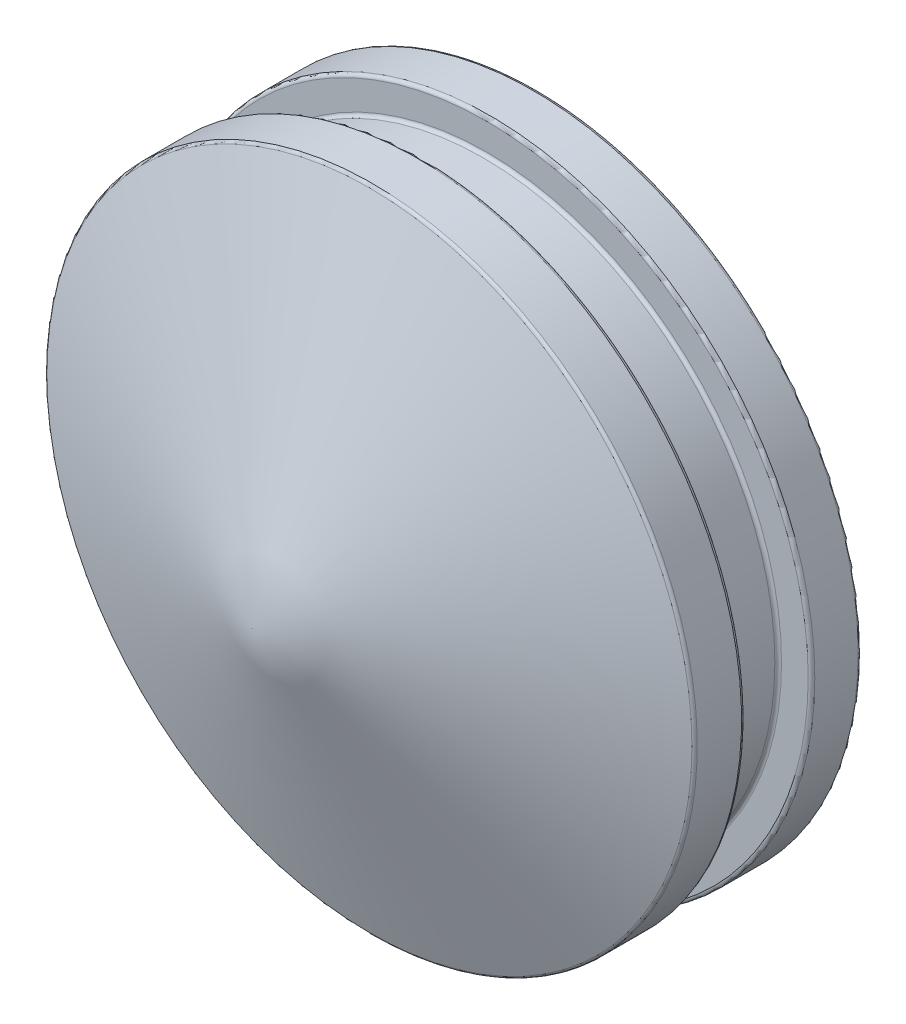
ISO-10303-21;
HEADER;
FILE_DESCRIPTION(('STEP AP214'),'2;1');
FILE_NAME('part.step','',(''),(''),'','','');
FILE_SCHEMA(('AUTOMOTIVE_DESIGN { 1 0 10303 214 1 1 1 1 }'));
ENDSEC;
DATA;
#1=APPLICATION_CONTEXT('core data for automotive mechanical design processes');
#2=APPLICATION_PROTOCOL_DEFINITION('international standard','automotive_design',2000,#1);
#3=PRODUCT_CONTEXT('',#1,'mechanical');
#4=PRODUCT('Part','Part','',(#3));
#5=PRODUCT_RELATED_PRODUCT_CATEGORY('part','',(#4));
#6=PRODUCT_DEFINITION_FORMATION('','',#4);
#7=PRODUCT_DEFINITION_CONTEXT('part definition',#1,'design');
#8=PRODUCT_DEFINITION('design','',#6,#7);
#9=PRODUCT_DEFINITION_SHAPE('','',#8);
#10=(LENGTH_UNIT() NAMED_UNIT(*) SI_UNIT(.MILLI.,.METRE.));
#11=(NAMED_UNIT(*) PLANE_ANGLE_UNIT() SI_UNIT($,.RADIAN.));
#12=(NAMED_UNIT(*) SI_UNIT($,.STERADIAN.) SOLID_ANGLE_UNIT());
#13=UNCERTAINTY_MEASURE_WITH_UNIT(LENGTH_MEASURE(1.E-05),#10,'distance_accuracy_value','');
#14=(GEOMETRIC_REPRESENTATION_CONTEXT(3) GLOBAL_UNCERTAINTY_ASSIGNED_CONTEXT((#13)) GLOBAL_UNIT_ASSIGNED_CONTEXT((#10,
#11,#12)) REPRESENTATION_CONTEXT('',''));
#15=CARTESIAN_POINT('',(0.,0.,0.));
#16=DIRECTION('',(0.,0.,1.));
#17=DIRECTION('',(1.,0.,0.));
#18=AXIS2_PLACEMENT_3D('',#15,#16,#17);
#19=CARTESIAN_POINT('',(8.75000000000004,0.,-7.04870978409553));
#20=DIRECTION('',(0.,0.,1.));
#21=DIRECTION('',(1.,0.,0.));
#22=AXIS2_PLACEMENT_3D('',#19,#20,#21);
#23=PLANE('',#22);
#24=CARTESIAN_POINT('',(0.,0.,-7.0487097840955));
#25=DIRECTION('',(0.,0.,1.));
#26=DIRECTION('',(1.,0.,0.));
#27=AXIS2_PLACEMENT_3D('',#24,#25,#26);
#28=CIRCLE('',#27,8.85000000000006);
#29=CARTESIAN_POINT('',(8.85000000000004,0.,-7.04870978409553));
#30=VERTEX_POINT('',#29);
#31=EDGE_CURVE('E127',#30,#30,#28,.F.);
#32=ORIENTED_EDGE('',*,*,#31,.T.);
#33=EDGE_LOOP('',(#32));
#34=FACE_BOUND('',#33,.T.);
#35=CARTESIAN_POINT('',(0.,0.,-7.0487097840955));
#36=DIRECTION('',(0.,0.,1.));
#37=DIRECTION('',(1.,0.,0.));
#38=AXIS2_PLACEMENT_3D('',#35,#36,#37);
#39=CIRCLE('',#38,9.65000000000007);
#40=CARTESIAN_POINT('',(9.65000000000004,0.,-7.04870978409553));
#41=VERTEX_POINT('',#40);
#42=EDGE_CURVE('E129',#41,#41,#39,.T.);
#43=ORIENTED_EDGE('',*,*,#42,.T.);
#44=EDGE_LOOP('',(#43));
#45=FACE_BOUND('',#44,.T.);
#46=ADVANCED_FACE('F32',(#34,#45),#23,.T.);
#47=CARTESIAN_POINT('',(3.49148133884313E-12,0.,1000.));
#48=DIRECTION('',(0.,0.,1.));
#49=DIRECTION('',(1.,0.,0.));
#50=AXIS2_PLACEMENT_3D('',#47,#48,#49);
#51=CYLINDRICAL_SURFACE('',#50,9.75000000000007);
#52=CARTESIAN_POINT('',(0.,0.,-8.44870978409551));
#53=DIRECTION('',(0.,0.,-1.));
#54=DIRECTION('',(-1.,0.,0.));
#55=AXIS2_PLACEMENT_3D('',#52,#53,#54);
#56=CIRCLE('',#55,9.75000000000007);
#57=CARTESIAN_POINT('',(-9.7500000000001,0.,-8.44870978409547));
#58=VERTEX_POINT('',#57);
#59=EDGE_CURVE('E119',#58,#58,#56,.F.);
#60=ORIENTED_EDGE('',*,*,#59,.T.);
#61=EDGE_LOOP('',(#60));
#62=FACE_BOUND('',#61,.T.);
#63=CARTESIAN_POINT('',(0.,0.,-7.14870978409543));
#64=DIRECTION('',(0.,0.,1.));
#65=DIRECTION('',(1.,0.,0.));
#66=AXIS2_PLACEMENT_3D('',#63,#64,#65);
#67=CIRCLE('',#66,9.75000000000007);
#68=CARTESIAN_POINT('',(9.75000000000004,0.,-7.14870978409546));
#69=VERTEX_POINT('',#68);
#70=EDGE_CURVE('E124',#69,#69,#67,.F.);
#71=ORIENTED_EDGE('',*,*,#70,.T.);
#72=EDGE_LOOP('',(#71));
#73=FACE_BOUND('',#72,.T.);
#74=ADVANCED_FACE('F59',(#62,#73),#51,.T.);
#75=CARTESIAN_POINT('',(9.75000000000004,0.,-8.54870978409554));
#76=DIRECTION('',(0.,0.,-1.));
#77=DIRECTION('',(-1.,0.,0.));
#78=AXIS2_PLACEMENT_3D('',#75,#76,#77);
#79=PLANE('',#78);
#80=CARTESIAN_POINT('',(0.,0.,-8.54870978409551));
#81=DIRECTION('',(0.,0.,-1.));
#82=DIRECTION('',(-1.,0.,0.));
#83=AXIS2_PLACEMENT_3D('',#80,#81,#82);
#84=CIRCLE('',#83,4.10000000000003);
#85=CARTESIAN_POINT('',(-4.10000000000006,0.,-8.54870978409549));
#86=VERTEX_POINT('',#85);
#87=EDGE_CURVE('E142',#86,#86,#84,.F.);
#88=ORIENTED_EDGE('',*,*,#87,.T.);
#89=EDGE_LOOP('',(#88));
#90=FACE_BOUND('',#89,.T.);
#91=CARTESIAN_POINT('',(0.,0.,-8.54870978409551));
#92=DIRECTION('',(0.,0.,-1.));
#93=DIRECTION('',(-1.,0.,0.));
#94=AXIS2_PLACEMENT_3D('',#91,#92,#93);
#95=CIRCLE('',#94,9.65000000000007);
#96=CARTESIAN_POINT('',(-9.6500000000001,0.,-8.54870978409548));
#97=VERTEX_POINT('',#96);
#98=EDGE_CURVE('E145',#97,#97,#95,.T.);
#99=ORIENTED_EDGE('',*,*,#98,.T.);
#100=EDGE_LOOP('',(#99));
#101=FACE_BOUND('',#100,.T.);
#102=ADVANCED_FACE('F65',(#90,#101),#79,.T.);
#103=CARTESIAN_POINT('',(3.49148133884313E-12,0.,1000.));
#104=DIRECTION('',(0.,0.,1.));
#105=DIRECTION('',(1.,0.,0.));
#106=AXIS2_PLACEMENT_3D('',#103,#104,#105);
#107=CYLINDRICAL_SURFACE('',#106,4.00000000000003);
#108=CARTESIAN_POINT('',(0.,0.,-6.14870978409554));
#109=DIRECTION('',(0.,0.,1.));
#110=DIRECTION('',(1.,0.,0.));
#111=AXIS2_PLACEMENT_3D('',#108,#109,#110);
#112=CIRCLE('',#111,4.00000000000003);
#113=CARTESIAN_POINT('',(4.,0.,-6.14870978409555));
#114=VERTEX_POINT('',#113);
#115=EDGE_CURVE('E163',#114,#114,#112,.T.);
#116=ORIENTED_EDGE('',*,*,#115,.T.);
#117=EDGE_LOOP('',(#116));
#118=FACE_BOUND('',#117,.T.);
#119=CARTESIAN_POINT('',(0.,0.,-8.44870978409551));
#120=DIRECTION('',(0.,0.,-1.));
#121=DIRECTION('',(-1.,0.,0.));
#122=AXIS2_PLACEMENT_3D('',#119,#120,#121);
#123=CIRCLE('',#122,4.00000000000003);
#124=CARTESIAN_POINT('',(-4.00000000000006,0.,-8.4487097840955));
#125=VERTEX_POINT('',#124);
#126=EDGE_CURVE('E166',#125,#125,#123,.T.);
#127=ORIENTED_EDGE('',*,*,#126,.T.);
#128=EDGE_LOOP('',(#127));
#129=FACE_BOUND('',#128,.T.);
#130=ADVANCED_FACE('F170',(#118,#129),#107,.F.);
#131=CARTESIAN_POINT('',(4.,0.,-6.04870978409553));
#132=DIRECTION('',(0.,0.,1.));
#133=DIRECTION('',(1.,0.,0.));
#134=AXIS2_PLACEMENT_3D('',#131,#132,#133);
#135=PLANE('',#134);
#136=CARTESIAN_POINT('',(0.,0.,-6.04870978409552));
#137=DIRECTION('',(0.,0.,1.));
#138=DIRECTION('',(1.,0.,0.));
#139=AXIS2_PLACEMENT_3D('',#136,#137,#138);
#140=CIRCLE('',#139,4.10000000000003);
#141=CARTESIAN_POINT('',(4.10000000000001,0.,-6.04870978409553));
#142=VERTEX_POINT('',#141);
#143=EDGE_CURVE('E157',#142,#142,#140,.F.);
#144=ORIENTED_EDGE('',*,*,#143,.T.);
#145=EDGE_LOOP('',(#144));
#146=FACE_BOUND('',#145,.T.);
#147=CARTESIAN_POINT('',(0.,0.,-6.04870978409552));
#148=DIRECTION('',(0.,0.,1.));
#149=DIRECTION('',(1.,0.,0.));
#150=AXIS2_PLACEMENT_3D('',#147,#148,#149);
#151=CIRCLE('',#150,4.90000000000002);
#152=CARTESIAN_POINT('',(4.9,0.,-6.04870978409553));
#153=VERTEX_POINT('',#152);
#154=EDGE_CURVE('E160',#153,#153,#151,.T.);
#155=ORIENTED_EDGE('',*,*,#154,.T.);
#156=EDGE_LOOP('',(#155));
#157=FACE_BOUND('',#156,.T.);
#158=ADVANCED_FACE('F186',(#146,#157),#135,.T.);
#159=CARTESIAN_POINT('',(3.49148133884313E-12,0.,1000.));
#160=DIRECTION('',(0.,0.,1.));
#161=DIRECTION('',(1.,0.,0.));
#162=AXIS2_PLACEMENT_3D('',#159,#160,#161);
#163=CYLINDRICAL_SURFACE('',#162,5.00000000000002);
#164=CARTESIAN_POINT('',(0.,0.,-4.64870978409548));
#165=DIRECTION('',(0.,0.,-1.));
#166=DIRECTION('',(-1.,0.,0.));
#167=AXIS2_PLACEMENT_3D('',#164,#165,#166);
#168=CIRCLE('',#167,5.00000000000002);
#169=CARTESIAN_POINT('',(-5.00000000000003,0.,-4.64870978409547));
#170=VERTEX_POINT('',#169);
#171=EDGE_CURVE('E151',#170,#170,#168,.F.);
#172=ORIENTED_EDGE('',*,*,#171,.T.);
#173=EDGE_LOOP('',(#172));
#174=FACE_BOUND('',#173,.T.);
#175=CARTESIAN_POINT('',(0.,0.,-5.94870978409556));
#176=DIRECTION('',(0.,0.,1.));
#177=DIRECTION('',(1.,0.,0.));
#178=AXIS2_PLACEMENT_3D('',#175,#176,#177);
#179=CIRCLE('',#178,5.00000000000002);
#180=CARTESIAN_POINT('',(5.,0.,-5.94870978409558));
#181=VERTEX_POINT('',#180);
#182=EDGE_CURVE('E154',#181,#181,#179,.F.);
#183=ORIENTED_EDGE('',*,*,#182,.T.);
#184=EDGE_LOOP('',(#183));
#185=FACE_BOUND('',#184,.T.);
#186=ADVANCED_FACE('F55',(#174,#185),#163,.F.);
#187=CARTESIAN_POINT('',(5.,0.,-4.54870978409554));
#188=DIRECTION('',(0.,0.,-1.));
#189=DIRECTION('',(-1.,0.,0.));
#190=AXIS2_PLACEMENT_3D('',#187,#188,#189);
#191=PLANE('',#190);
#192=CARTESIAN_POINT('',(0.,0.,-4.54870978409552));
#193=DIRECTION('',(0.,0.,-1.));
#194=DIRECTION('',(-1.,0.,0.));
#195=AXIS2_PLACEMENT_3D('',#192,#193,#194);
#196=CIRCLE('',#195,4.90000000000002);
#197=CARTESIAN_POINT('',(-4.90000000000003,0.,-4.54870978409551));
#198=VERTEX_POINT('',#197);
#199=EDGE_CURVE('E148',#198,#198,#196,.T.);
#200=ORIENTED_EDGE('',*,*,#199,.T.);
#201=EDGE_LOOP('',(#200));
#202=FACE_BOUND('',#201,.T.);
#203=ADVANCED_FACE('F45',(#202),#191,.T.);
#204=CARTESIAN_POINT('',(0.,0.,0.));
#205=DIRECTION('',(0.,0.,-1.));
#206=DIRECTION('',(-1.,0.,0.));
#207=AXIS2_PLACEMENT_3D('',#204,#205,#206);
#208=CONICAL_SURFACE('',#207,0.,1.22173047639602);
#209=CARTESIAN_POINT('',(0.,0.,-3.52476127583798));
#210=DIRECTION('',(0.,0.,1.));
#211=DIRECTION('',(1.,0.,0.));
#212=AXIS2_PLACEMENT_3D('',#209,#210,#211);
#213=CIRCLE('',#212,9.6842020143326);
#214=CARTESIAN_POINT('',(9.68420201433259,0.,-3.52476127583801));
#215=VERTEX_POINT('',#214);
#216=EDGE_CURVE('E11',#215,#215,#213,.T.);
#217=ORIENTED_EDGE('',*,*,#216,.T.);
#218=EDGE_LOOP('',(#217));
#219=FACE_BOUND('',#218,.T.);
#220=CARTESIAN_POINT('',(0.,0.,0.));
#221=VERTEX_POINT('',#220);
#222=VERTEX_LOOP('',#221);
#223=FACE_BOUND('',#222,.T.);
#224=ADVANCED_FACE('F42',(#219,#223),#208,.T.);
#225=CARTESIAN_POINT('',(3.49148133884313E-12,0.,1000.));
#226=DIRECTION('',(0.,0.,1.));
#227=DIRECTION('',(1.,0.,0.));
#228=AXIS2_PLACEMENT_3D('',#225,#226,#227);
#229=CYLINDRICAL_SURFACE('',#228,9.75000000000006);
#230=CARTESIAN_POINT('',(0.,0.,-4.94870978409545));
#231=DIRECTION('',(0.,0.,-1.));
#232=DIRECTION('',(-1.,0.,0.));
#233=AXIS2_PLACEMENT_3D('',#230,#231,#232);
#234=CIRCLE('',#233,9.75000000000006);
#235=CARTESIAN_POINT('',(-9.75000000000007,0.,-4.94870978409542));
#236=VERTEX_POINT('',#235);
#237=EDGE_CURVE('E39',#236,#236,#234,.F.);
#238=ORIENTED_EDGE('',*,*,#237,.T.);
#239=EDGE_LOOP('',(#238));
#240=FACE_BOUND('',#239,.T.);
#241=CARTESIAN_POINT('',(0.,0.,-3.6187305379165));
#242=DIRECTION('',(0.,0.,-1.));
#243=DIRECTION('',(-1.,0.,0.));
#244=AXIS2_PLACEMENT_3D('',#241,#242,#243);
#245=CIRCLE('',#244,9.75000000000006);
#246=CARTESIAN_POINT('',(-9.75000000000007,0.,-3.61873053791647));
#247=VERTEX_POINT('',#246);
#248=EDGE_CURVE('E117',#247,#247,#245,.T.);
#249=ORIENTED_EDGE('',*,*,#248,.T.);
#250=EDGE_LOOP('',(#249));
#251=FACE_BOUND('',#250,.T.);
#252=ADVANCED_FACE('F44',(#240,#251),#229,.T.);
#253=CARTESIAN_POINT('',(9.75000000000004,0.,-5.04870978409553));
#254=DIRECTION('',(0.,0.,-1.));
#255=DIRECTION('',(-1.,0.,0.));
#256=AXIS2_PLACEMENT_3D('',#253,#254,#255);
#257=PLANE('',#256);
#258=CARTESIAN_POINT('',(0.,0.,-5.0487097840955));
#259=DIRECTION('',(0.,0.,-1.));
#260=DIRECTION('',(-1.,0.,0.));
#261=AXIS2_PLACEMENT_3D('',#258,#259,#260);
#262=CIRCLE('',#261,8.85000000000006);
#263=CARTESIAN_POINT('',(-8.85000000000008,0.,-5.04870978409547));
#264=VERTEX_POINT('',#263);
#265=EDGE_CURVE('E138',#264,#264,#262,.F.);
#266=ORIENTED_EDGE('',*,*,#265,.T.);
#267=EDGE_LOOP('',(#266));
#268=FACE_BOUND('',#267,.T.);
#269=CARTESIAN_POINT('',(0.,0.,-5.0487097840955));
#270=DIRECTION('',(0.,0.,-1.));
#271=DIRECTION('',(-1.,0.,0.));
#272=AXIS2_PLACEMENT_3D('',#269,#270,#271);
#273=CIRCLE('',#272,9.65000000000006);
#274=CARTESIAN_POINT('',(-9.65000000000007,0.,-5.04870978409547));
#275=VERTEX_POINT('',#274);
#276=EDGE_CURVE('E114',#275,#275,#273,.T.);
#277=ORIENTED_EDGE('',*,*,#276,.T.);
#278=EDGE_LOOP('',(#277));
#279=FACE_BOUND('',#278,.T.);
#280=ADVANCED_FACE('F52',(#268,#279),#257,.T.);
#281=CARTESIAN_POINT('',(3.49148133884313E-12,0.,1000.));
#282=DIRECTION('',(0.,0.,1.));
#283=DIRECTION('',(1.,0.,0.));
#284=AXIS2_PLACEMENT_3D('',#281,#282,#283);
#285=CYLINDRICAL_SURFACE('',#284,8.75000000000006);
#286=CARTESIAN_POINT('',(0.,0.,-5.14870978409543));
#287=DIRECTION('',(0.,0.,-1.));
#288=DIRECTION('',(-1.,0.,0.));
#289=AXIS2_PLACEMENT_3D('',#286,#287,#288);
#290=CIRCLE('',#289,8.75000000000006);
#291=CARTESIAN_POINT('',(-8.75000000000008,0.,-5.1487097840954));
#292=VERTEX_POINT('',#291);
#293=EDGE_CURVE('E132',#292,#292,#290,.T.);
#294=ORIENTED_EDGE('',*,*,#293,.T.);
#295=EDGE_LOOP('',(#294));
#296=FACE_BOUND('',#295,.T.);
#297=CARTESIAN_POINT('',(0.,0.,-6.94870978409545));
#298=DIRECTION('',(0.,0.,1.));
#299=DIRECTION('',(1.,0.,0.));
#300=AXIS2_PLACEMENT_3D('',#297,#298,#299);
#301=CIRCLE('',#300,8.75000000000006);
#302=CARTESIAN_POINT('',(8.75000000000004,0.,-6.94870978409548));
#303=VERTEX_POINT('',#302);
#304=EDGE_CURVE('E135',#303,#303,#301,.T.);
#305=ORIENTED_EDGE('',*,*,#304,.T.);
#306=EDGE_LOOP('',(#305));
#307=FACE_BOUND('',#306,.T.);
#308=ADVANCED_FACE('F76',(#296,#307),#285,.T.);
#309=CARTESIAN_POINT('',(0.,0.,-6.14870978409554));
#310=DIRECTION('',(0.,0.,1.));
#311=DIRECTION('',(1.,0.,0.));
#312=AXIS2_PLACEMENT_3D('',#309,#310,#311);
#313=TOROIDAL_SURFACE('',#312,4.10000000000003,0.1);
#314=ORIENTED_EDGE('',*,*,#143,.F.);
#315=EDGE_LOOP('',(#314));
#316=FACE_BOUND('',#315,.T.);
#317=ORIENTED_EDGE('',*,*,#115,.F.);
#318=EDGE_LOOP('',(#317));
#319=FACE_BOUND('',#318,.T.);
#320=ADVANCED_FACE('F72',(#316,#319),#313,.T.);
#321=CARTESIAN_POINT('',(0.,0.,-4.64870978409548));
#322=DIRECTION('',(0.,0.,-1.));
#323=DIRECTION('',(-1.,0.,0.));
#324=AXIS2_PLACEMENT_3D('',#321,#322,#323);
#325=TOROIDAL_SURFACE('',#324,4.90000000000002,0.1);
#326=ORIENTED_EDGE('',*,*,#199,.F.);
#327=EDGE_LOOP('',(#326));
#328=FACE_BOUND('',#327,.T.);
#329=ORIENTED_EDGE('',*,*,#171,.F.);
#330=EDGE_LOOP('',(#329));
#331=FACE_BOUND('',#330,.T.);
#332=ADVANCED_FACE('F75',(#328,#331),#325,.F.);
#333=CARTESIAN_POINT('',(0.,0.,-5.94870978409556));
#334=DIRECTION('',(0.,0.,1.));
#335=DIRECTION('',(1.,0.,0.));
#336=AXIS2_PLACEMENT_3D('',#333,#334,#335);
#337=TOROIDAL_SURFACE('',#336,4.90000000000002,0.1);
#338=ORIENTED_EDGE('',*,*,#182,.F.);
#339=EDGE_LOOP('',(#338));
#340=FACE_BOUND('',#339,.T.);
#341=ORIENTED_EDGE('',*,*,#154,.F.);
#342=EDGE_LOOP('',(#341));
#343=FACE_BOUND('',#342,.T.);
#344=ADVANCED_FACE('F80',(#340,#343),#337,.F.);
#345=CARTESIAN_POINT('',(0.,0.,-8.44870978409551));
#346=DIRECTION('',(0.,0.,-1.));
#347=DIRECTION('',(-1.,0.,0.));
#348=AXIS2_PLACEMENT_3D('',#345,#346,#347);
#349=TOROIDAL_SURFACE('',#348,4.10000000000003,0.1);
#350=ORIENTED_EDGE('',*,*,#126,.F.);
#351=EDGE_LOOP('',(#350));
#352=FACE_BOUND('',#351,.T.);
#353=ORIENTED_EDGE('',*,*,#87,.F.);
#354=EDGE_LOOP('',(#353));
#355=FACE_BOUND('',#354,.T.);
#356=ADVANCED_FACE('F84',(#352,#355),#349,.T.);
#357=CARTESIAN_POINT('',(0.,0.,-5.14870978409543));
#358=DIRECTION('',(0.,0.,-1.));
#359=DIRECTION('',(-1.,0.,0.));
#360=AXIS2_PLACEMENT_3D('',#357,#358,#359);
#361=TOROIDAL_SURFACE('',#360,8.85000000000006,0.1);
#362=ORIENTED_EDGE('',*,*,#293,.F.);
#363=EDGE_LOOP('',(#362));
#364=FACE_BOUND('',#363,.T.);
#365=ORIENTED_EDGE('',*,*,#265,.F.);
#366=EDGE_LOOP('',(#365));
#367=FACE_BOUND('',#366,.T.);
#368=ADVANCED_FACE('F88',(#364,#367),#361,.F.);
#369=CARTESIAN_POINT('',(0.,0.,-6.94870978409545));
#370=DIRECTION('',(0.,0.,1.));
#371=DIRECTION('',(1.,0.,0.));
#372=AXIS2_PLACEMENT_3D('',#369,#370,#371);
#373=TOROIDAL_SURFACE('',#372,8.85000000000006,0.1);
#374=ORIENTED_EDGE('',*,*,#31,.F.);
#375=EDGE_LOOP('',(#374));
#376=FACE_BOUND('',#375,.T.);
#377=ORIENTED_EDGE('',*,*,#304,.F.);
#378=EDGE_LOOP('',(#377));
#379=FACE_BOUND('',#378,.T.);
#380=ADVANCED_FACE('F92',(#376,#379),#373,.F.);
#381=CARTESIAN_POINT('',(0.,0.,-8.44870978409551));
#382=DIRECTION('',(0.,0.,-1.));
#383=DIRECTION('',(-1.,0.,0.));
#384=AXIS2_PLACEMENT_3D('',#381,#382,#383);
#385=TOROIDAL_SURFACE('',#384,9.65000000000007,0.1);
#386=ORIENTED_EDGE('',*,*,#98,.F.);
#387=EDGE_LOOP('',(#386));
#388=FACE_BOUND('',#387,.T.);
#389=ORIENTED_EDGE('',*,*,#59,.F.);
#390=EDGE_LOOP('',(#389));
#391=FACE_BOUND('',#390,.T.);
#392=ADVANCED_FACE('F96',(#388,#391),#385,.T.);
#393=CARTESIAN_POINT('',(0.,0.,-7.14870978409543));
#394=DIRECTION('',(0.,0.,1.));
#395=DIRECTION('',(1.,0.,0.));
#396=AXIS2_PLACEMENT_3D('',#393,#394,#395);
#397=TOROIDAL_SURFACE('',#396,9.65000000000007,0.1);
#398=ORIENTED_EDGE('',*,*,#70,.F.);
#399=EDGE_LOOP('',(#398));
#400=FACE_BOUND('',#399,.T.);
#401=ORIENTED_EDGE('',*,*,#42,.F.);
#402=EDGE_LOOP('',(#401));
#403=FACE_BOUND('',#402,.T.);
#404=ADVANCED_FACE('F100',(#400,#403),#397,.T.);
#405=CARTESIAN_POINT('',(0.,0.,-4.94870978409545));
#406=DIRECTION('',(0.,0.,-1.));
#407=DIRECTION('',(-1.,0.,0.));
#408=AXIS2_PLACEMENT_3D('',#405,#406,#407);
#409=TOROIDAL_SURFACE('',#408,9.65000000000006,0.1);
#410=ORIENTED_EDGE('',*,*,#276,.F.);
#411=EDGE_LOOP('',(#410));
#412=FACE_BOUND('',#411,.T.);
#413=ORIENTED_EDGE('',*,*,#237,.F.);
#414=EDGE_LOOP('',(#413));
#415=FACE_BOUND('',#414,.T.);
#416=ADVANCED_FACE('F103',(#412,#415),#409,.T.);
#417=CARTESIAN_POINT('',(0.,0.,-3.6187305379165));
#418=DIRECTION('',(0.,0.,-1.));
#419=DIRECTION('',(-1.,0.,0.));
#420=AXIS2_PLACEMENT_3D('',#417,#418,#419);
#421=TOROIDAL_SURFACE('',#420,9.65000000000006,0.1);
#422=ORIENTED_EDGE('',*,*,#248,.F.);
#423=EDGE_LOOP('',(#422));
#424=FACE_BOUND('',#423,.T.);
#425=ORIENTED_EDGE('',*,*,#216,.F.);
#426=EDGE_LOOP('',(#425));
#427=FACE_BOUND('',#426,.T.);
#428=ADVANCED_FACE('F34',(#424,#427),#421,.T.);
#429=CLOSED_SHELL('',(#46,#74,#102,#130,#158,#186,#203,#224,#252,#280,#308,#320,#332,#344,#356,
#368,#380,#392,#404,#416,#428));
#430=MANIFOLD_SOLID_BREP('B2',#429);
#431=ADVANCED_BREP_SHAPE_REPRESENTATION('',(#18,#430),#14);
#432=SHAPE_DEFINITION_REPRESENTATION(#9,#431);
ENDSEC;
END-ISO-10303-21;
